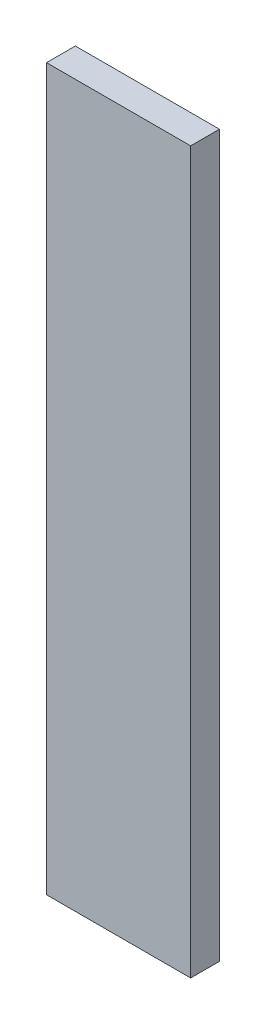
ISO-10303-21;
HEADER;
FILE_DESCRIPTION(('STEP AP214'),'2;1');
FILE_NAME('part.step','',(''),(''),'','','');
FILE_SCHEMA(('AUTOMOTIVE_DESIGN { 1 0 10303 214 1 1 1 1 }'));
ENDSEC;
DATA;
#1=APPLICATION_CONTEXT('core data for automotive mechanical design processes');
#2=APPLICATION_PROTOCOL_DEFINITION('international standard','automotive_design',2000,#1);
#3=PRODUCT_CONTEXT('',#1,'mechanical');
#4=PRODUCT('Part','Part','',(#3));
#5=PRODUCT_RELATED_PRODUCT_CATEGORY('part','',(#4));
#6=PRODUCT_DEFINITION_FORMATION('','',#4);
#7=PRODUCT_DEFINITION_CONTEXT('part definition',#1,'design');
#8=PRODUCT_DEFINITION('design','',#6,#7);
#9=PRODUCT_DEFINITION_SHAPE('','',#8);
#10=(LENGTH_UNIT() NAMED_UNIT(*) SI_UNIT(.MILLI.,.METRE.));
#11=(NAMED_UNIT(*) PLANE_ANGLE_UNIT() SI_UNIT($,.RADIAN.));
#12=(NAMED_UNIT(*) SI_UNIT($,.STERADIAN.) SOLID_ANGLE_UNIT());
#13=UNCERTAINTY_MEASURE_WITH_UNIT(LENGTH_MEASURE(1.E-05),#10,'distance_accuracy_value','');
#14=(GEOMETRIC_REPRESENTATION_CONTEXT(3) GLOBAL_UNCERTAINTY_ASSIGNED_CONTEXT((#13)) GLOBAL_UNIT_ASSIGNED_CONTEXT((#10,
#11,#12)) REPRESENTATION_CONTEXT('',''));
#15=CARTESIAN_POINT('',(0.,0.,0.));
#16=DIRECTION('',(0.,0.,1.));
#17=DIRECTION('',(1.,0.,0.));
#18=AXIS2_PLACEMENT_3D('',#15,#16,#17);
#19=CARTESIAN_POINT('',(0.,50.,0.));
#20=DIRECTION('',(1.,0.,0.));
#21=DIRECTION('',(0.,0.,-1.));
#22=AXIS2_PLACEMENT_3D('',#19,#20,#21);
#23=PLANE('',#22);
#24=DIRECTION('',(0.,0.,1.));
#25=VECTOR('',#24,1.);
#26=CARTESIAN_POINT('',(0.,0.,0.));
#27=LINE('',#26,#25);
#28=CARTESIAN_POINT('',(0.,0.,-2.));
#29=VERTEX_POINT('',#28);
#30=CARTESIAN_POINT('',(0.,0.,0.));
#31=VERTEX_POINT('',#30);
#32=EDGE_CURVE('E97',#29,#31,#27,.T.);
#33=ORIENTED_EDGE('',*,*,#32,.T.);
#34=DIRECTION('',(0.,-1.,0.));
#35=VECTOR('',#34,1.);
#36=CARTESIAN_POINT('',(0.,50.,0.));
#37=LINE('',#36,#35);
#38=CARTESIAN_POINT('',(0.,50.,0.));
#39=VERTEX_POINT('',#38);
#40=EDGE_CURVE('E11',#39,#31,#37,.T.);
#41=ORIENTED_EDGE('',*,*,#40,.F.);
#42=DIRECTION('',(0.,0.,1.));
#43=VECTOR('',#42,1.);
#44=CARTESIAN_POINT('',(0.,50.,0.));
#45=LINE('',#44,#43);
#46=CARTESIAN_POINT('',(0.,50.,-2.));
#47=VERTEX_POINT('',#46);
#48=EDGE_CURVE('E85',#47,#39,#45,.T.);
#49=ORIENTED_EDGE('',*,*,#48,.F.);
#50=DIRECTION('',(0.,-1.,0.));
#51=VECTOR('',#50,1.);
#52=CARTESIAN_POINT('',(0.,50.,-2.));
#53=LINE('',#52,#51);
#54=EDGE_CURVE('E93',#47,#29,#53,.T.);
#55=ORIENTED_EDGE('',*,*,#54,.T.);
#56=EDGE_LOOP('',(#33,#41,#49,#55));
#57=FACE_BOUND('',#56,.T.);
#58=ADVANCED_FACE('F34',(#57),#23,.F.);
#59=CARTESIAN_POINT('',(0.,50.,0.));
#60=DIRECTION('',(0.,0.,-1.));
#61=DIRECTION('',(-1.,0.,0.));
#62=AXIS2_PLACEMENT_3D('',#59,#60,#61);
#63=PLANE('',#62);
#64=DIRECTION('',(1.,0.,0.));
#65=VECTOR('',#64,1.);
#66=CARTESIAN_POINT('',(0.,0.,0.));
#67=LINE('',#66,#65);
#68=CARTESIAN_POINT('',(10.,0.,0.));
#69=VERTEX_POINT('',#68);
#70=EDGE_CURVE('E89',#31,#69,#67,.T.);
#71=ORIENTED_EDGE('',*,*,#70,.T.);
#72=DIRECTION('',(0.,-1.,0.));
#73=VECTOR('',#72,1.);
#74=CARTESIAN_POINT('',(10.,50.,0.));
#75=LINE('',#74,#73);
#76=CARTESIAN_POINT('',(10.,50.,0.));
#77=VERTEX_POINT('',#76);
#78=EDGE_CURVE('E42',#77,#69,#75,.T.);
#79=ORIENTED_EDGE('',*,*,#78,.F.);
#80=DIRECTION('',(1.,0.,0.));
#81=VECTOR('',#80,1.);
#82=CARTESIAN_POINT('',(0.,50.,0.));
#83=LINE('',#82,#81);
#84=EDGE_CURVE('E80',#39,#77,#83,.T.);
#85=ORIENTED_EDGE('',*,*,#84,.F.);
#86=ORIENTED_EDGE('',*,*,#40,.T.);
#87=EDGE_LOOP('',(#71,#79,#85,#86));
#88=FACE_BOUND('',#87,.T.);
#89=ADVANCED_FACE('F88',(#88),#63,.F.);
#90=CARTESIAN_POINT('',(10.,50.,0.));
#91=DIRECTION('',(-1.,0.,0.));
#92=DIRECTION('',(0.,0.,1.));
#93=AXIS2_PLACEMENT_3D('',#90,#91,#92);
#94=PLANE('',#93);
#95=DIRECTION('',(0.,0.,-1.));
#96=VECTOR('',#95,1.);
#97=CARTESIAN_POINT('',(10.,0.,0.));
#98=LINE('',#97,#96);
#99=CARTESIAN_POINT('',(10.,0.,-2.));
#100=VERTEX_POINT('',#99);
#101=EDGE_CURVE('E67',#69,#100,#98,.T.);
#102=ORIENTED_EDGE('',*,*,#101,.T.);
#103=DIRECTION('',(0.,-1.,0.));
#104=VECTOR('',#103,1.);
#105=CARTESIAN_POINT('',(10.,50.,-2.));
#106=LINE('',#105,#104);
#107=CARTESIAN_POINT('',(10.,50.,-2.));
#108=VERTEX_POINT('',#107);
#109=EDGE_CURVE('E90',#108,#100,#106,.T.);
#110=ORIENTED_EDGE('',*,*,#109,.F.);
#111=DIRECTION('',(0.,0.,-1.));
#112=VECTOR('',#111,1.);
#113=CARTESIAN_POINT('',(10.,50.,0.));
#114=LINE('',#113,#112);
#115=EDGE_CURVE('E83',#77,#108,#114,.T.);
#116=ORIENTED_EDGE('',*,*,#115,.F.);
#117=ORIENTED_EDGE('',*,*,#78,.T.);
#118=EDGE_LOOP('',(#102,#110,#116,#117));
#119=FACE_BOUND('',#118,.T.);
#120=ADVANCED_FACE('F91',(#119),#94,.F.);
#121=CARTESIAN_POINT('',(0.,50.,-2.));
#122=DIRECTION('',(0.,0.,1.));
#123=DIRECTION('',(1.,0.,0.));
#124=AXIS2_PLACEMENT_3D('',#121,#122,#123);
#125=PLANE('',#124);
#126=DIRECTION('',(-1.,0.,0.));
#127=VECTOR('',#126,1.);
#128=CARTESIAN_POINT('',(0.,0.,-2.));
#129=LINE('',#128,#127);
#130=EDGE_CURVE('E73',#100,#29,#129,.T.);
#131=ORIENTED_EDGE('',*,*,#130,.T.);
#132=ORIENTED_EDGE('',*,*,#54,.F.);
#133=DIRECTION('',(-1.,0.,0.));
#134=VECTOR('',#133,1.);
#135=CARTESIAN_POINT('',(0.,50.,-2.));
#136=LINE('',#135,#134);
#137=EDGE_CURVE('E50',#108,#47,#136,.T.);
#138=ORIENTED_EDGE('',*,*,#137,.F.);
#139=ORIENTED_EDGE('',*,*,#109,.T.);
#140=EDGE_LOOP('',(#131,#132,#138,#139));
#141=FACE_BOUND('',#140,.T.);
#142=ADVANCED_FACE('F104',(#141),#125,.F.);
#143=CARTESIAN_POINT('',(0.,50.,0.));
#144=DIRECTION('',(0.,-1.,0.));
#145=DIRECTION('',(0.,0.,-1.));
#146=AXIS2_PLACEMENT_3D('',#143,#144,#145);
#147=PLANE('',#146);
#148=ORIENTED_EDGE('',*,*,#48,.T.);
#149=ORIENTED_EDGE('',*,*,#84,.T.);
#150=ORIENTED_EDGE('',*,*,#115,.T.);
#151=ORIENTED_EDGE('',*,*,#137,.T.);
#152=EDGE_LOOP('',(#148,#149,#150,#151));
#153=FACE_BOUND('',#152,.T.);
#154=ADVANCED_FACE('F81',(#153),#147,.F.);
#155=CARTESIAN_POINT('',(0.,0.,0.));
#156=DIRECTION('',(0.,-1.,0.));
#157=DIRECTION('',(0.,0.,-1.));
#158=AXIS2_PLACEMENT_3D('',#155,#156,#157);
#159=PLANE('',#158);
#160=ORIENTED_EDGE('',*,*,#32,.F.);
#161=ORIENTED_EDGE('',*,*,#130,.F.);
#162=ORIENTED_EDGE('',*,*,#101,.F.);
#163=ORIENTED_EDGE('',*,*,#70,.F.);
#164=EDGE_LOOP('',(#160,#161,#162,#163));
#165=FACE_BOUND('',#164,.T.);
#166=ADVANCED_FACE('F107',(#165),#159,.T.);
#167=CLOSED_SHELL('',(#58,#89,#120,#142,#154,#166));
#168=MANIFOLD_SOLID_BREP('B2',#167);
#169=ADVANCED_BREP_SHAPE_REPRESENTATION('',(#18,#168),#14);
#170=SHAPE_DEFINITION_REPRESENTATION(#9,#169);
ENDSEC;
END-ISO-10303-21;
